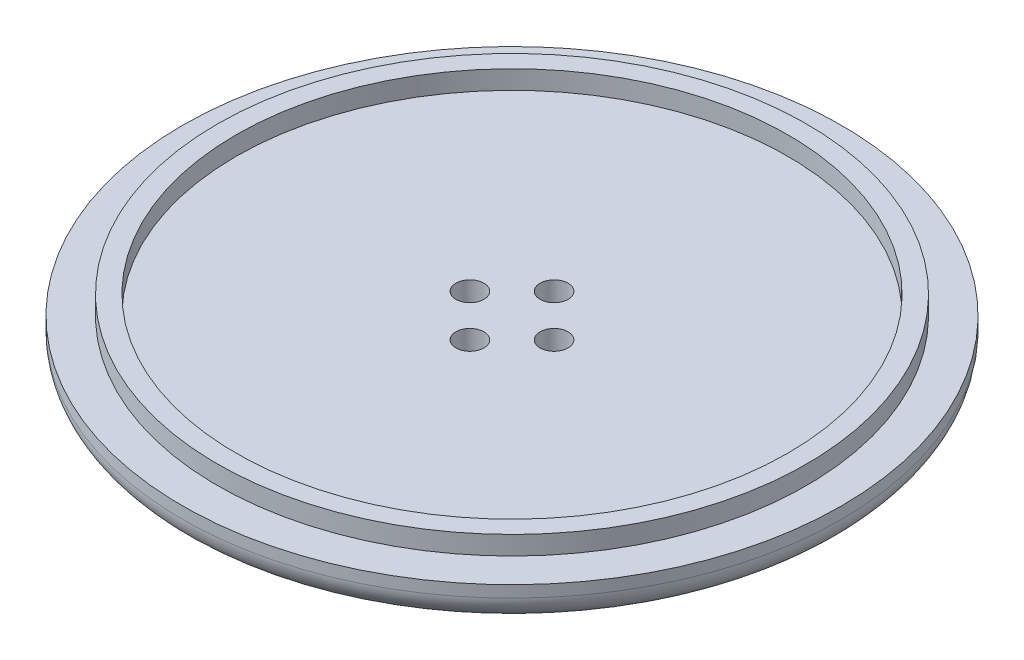
ISO-10303-21;
HEADER;
FILE_DESCRIPTION(('STEP AP214'),'2;1');
FILE_NAME('part.step','',(''),(''),'','','');
FILE_SCHEMA(('AUTOMOTIVE_DESIGN { 1 0 10303 214 1 1 1 1 }'));
ENDSEC;
DATA;
#1=APPLICATION_CONTEXT('core data for automotive mechanical design processes');
#2=APPLICATION_PROTOCOL_DEFINITION('international standard','automotive_design',2000,#1);
#3=PRODUCT_CONTEXT('',#1,'mechanical');
#4=PRODUCT('Part','Part','',(#3));
#5=PRODUCT_RELATED_PRODUCT_CATEGORY('part','',(#4));
#6=PRODUCT_DEFINITION_FORMATION('','',#4);
#7=PRODUCT_DEFINITION_CONTEXT('part definition',#1,'design');
#8=PRODUCT_DEFINITION('design','',#6,#7);
#9=PRODUCT_DEFINITION_SHAPE('','',#8);
#10=(LENGTH_UNIT() NAMED_UNIT(*) SI_UNIT(.MILLI.,.METRE.));
#11=(NAMED_UNIT(*) PLANE_ANGLE_UNIT() SI_UNIT($,.RADIAN.));
#12=(NAMED_UNIT(*) SI_UNIT($,.STERADIAN.) SOLID_ANGLE_UNIT());
#13=UNCERTAINTY_MEASURE_WITH_UNIT(LENGTH_MEASURE(1.E-05),#10,'distance_accuracy_value','');
#14=(GEOMETRIC_REPRESENTATION_CONTEXT(3) GLOBAL_UNCERTAINTY_ASSIGNED_CONTEXT((#13)) GLOBAL_UNIT_ASSIGNED_CONTEXT((#10,
#11,#12)) REPRESENTATION_CONTEXT('',''));
#15=CARTESIAN_POINT('',(0.,0.,0.));
#16=DIRECTION('',(0.,0.,1.));
#17=DIRECTION('',(1.,0.,0.));
#18=AXIS2_PLACEMENT_3D('',#15,#16,#17);
#19=CARTESIAN_POINT('',(55.5000026361085,129.291677668399,0.));
#20=DIRECTION('',(0.,-1.,0.));
#21=DIRECTION('',(-1.,0.,0.));
#22=AXIS2_PLACEMENT_3D('',#19,#20,#21);
#23=CYLINDRICAL_SURFACE('',#22,35.2437204650337);
#24=CARTESIAN_POINT('',(55.5000026361085,129.914426858839,0.));
#25=DIRECTION('',(0.,1.,0.));
#26=DIRECTION('',(1.,0.,0.));
#27=AXIS2_PLACEMENT_3D('',#24,#25,#26);
#28=CIRCLE('',#27,35.2437204650337);
#29=CARTESIAN_POINT('',(20.2562821710748,129.914426858839,0.));
#30=VERTEX_POINT('',#29);
#31=EDGE_CURVE('E97',#30,#30,#28,.T.);
#32=ORIENTED_EDGE('',*,*,#31,.F.);
#33=EDGE_LOOP('',(#32));
#34=FACE_BOUND('',#33,.T.);
#35=CARTESIAN_POINT('',(55.5000026361085,128.668928477959,0.));
#36=DIRECTION('',(0.,1.,0.));
#37=DIRECTION('',(1.,0.,0.));
#38=AXIS2_PLACEMENT_3D('',#35,#36,#37);
#39=CIRCLE('',#38,35.2437204650337);
#40=CARTESIAN_POINT('',(20.2562821710748,128.668928477959,0.));
#41=VERTEX_POINT('',#40);
#42=EDGE_CURVE('E10',#41,#41,#39,.T.);
#43=ORIENTED_EDGE('',*,*,#42,.T.);
#44=EDGE_LOOP('',(#43));
#45=FACE_BOUND('',#44,.T.);
#46=ADVANCED_FACE('F15',(#34,#45),#23,.T.);
#47=CARTESIAN_POINT('',(55.5000026361085,128.668928477959,0.));
#48=DIRECTION('',(0.,1.,0.));
#49=DIRECTION('',(0.,0.,1.));
#50=AXIS2_PLACEMENT_3D('',#47,#48,#49);
#51=TOROIDAL_SURFACE('',#50,32.4937204650337,2.75000000000005);
#52=ORIENTED_EDGE('',*,*,#42,.F.);
#53=EDGE_LOOP('',(#52));
#54=FACE_BOUND('',#53,.T.);
#55=CARTESIAN_POINT('',(55.5000026361085,125.918928477959,0.));
#56=DIRECTION('',(0.,1.,0.));
#57=DIRECTION('',(1.,0.,0.));
#58=AXIS2_PLACEMENT_3D('',#55,#56,#57);
#59=CIRCLE('',#58,32.4937204650338);
#60=CARTESIAN_POINT('',(23.0062821710748,125.918928477959,0.));
#61=VERTEX_POINT('',#60);
#62=EDGE_CURVE('E25',#61,#61,#59,.T.);
#63=ORIENTED_EDGE('',*,*,#62,.T.);
#64=EDGE_LOOP('',(#63));
#65=FACE_BOUND('',#64,.T.);
#66=ADVANCED_FACE('F171',(#54,#65),#51,.T.);
#67=CARTESIAN_POINT('',(23.0062821710748,125.918928477959,0.));
#68=DIRECTION('',(0.,-1.,0.));
#69=DIRECTION('',(0.,0.,-1.));
#70=AXIS2_PLACEMENT_3D('',#67,#68,#69);
#71=PLANE('',#70);
#72=ORIENTED_EDGE('',*,*,#62,.F.);
#73=EDGE_LOOP('',(#72));
#74=FACE_BOUND('',#73,.T.);
#75=CARTESIAN_POINT('',(55.5000026361085,125.918928477959,0.));
#76=DIRECTION('',(0.,1.,0.));
#77=DIRECTION('',(1.,0.,0.));
#78=AXIS2_PLACEMENT_3D('',#75,#76,#77);
#79=CIRCLE('',#78,19.0000020698644);
#80=CARTESIAN_POINT('',(36.5000005662441,125.918928477959,0.));
#81=VERTEX_POINT('',#80);
#82=EDGE_CURVE('E111',#81,#81,#79,.T.);
#83=ORIENTED_EDGE('',*,*,#82,.T.);
#84=EDGE_LOOP('',(#83));
#85=FACE_BOUND('',#84,.T.);
#86=ADVANCED_FACE('F177',(#74,#85),#71,.T.);
#87=CARTESIAN_POINT('',(55.5000026361085,124.418928477959,0.));
#88=DIRECTION('',(0.,1.,0.));
#89=DIRECTION('',(0.,0.,1.));
#90=AXIS2_PLACEMENT_3D('',#87,#88,#89);
#91=TOROIDAL_SURFACE('',#90,19.0000020698644,1.5);
#92=ORIENTED_EDGE('',*,*,#82,.F.);
#93=EDGE_LOOP('',(#92));
#94=FACE_BOUND('',#93,.T.);
#95=CARTESIAN_POINT('',(55.5000026361085,124.418928477959,0.));
#96=DIRECTION('',(0.,1.,0.));
#97=DIRECTION('',(1.,0.,0.));
#98=AXIS2_PLACEMENT_3D('',#95,#96,#97);
#99=CIRCLE('',#98,17.5000020698644);
#100=CARTESIAN_POINT('',(38.0000005662441,124.418928477959,0.));
#101=VERTEX_POINT('',#100);
#102=EDGE_CURVE('E19',#101,#101,#99,.T.);
#103=ORIENTED_EDGE('',*,*,#102,.T.);
#104=EDGE_LOOP('',(#103));
#105=FACE_BOUND('',#104,.T.);
#106=ADVANCED_FACE('F17',(#94,#105),#91,.F.);
#107=CARTESIAN_POINT('',(55.5000026361085,124.168928477959,0.));
#108=DIRECTION('',(0.,-1.,0.));
#109=DIRECTION('',(-1.,0.,0.));
#110=AXIS2_PLACEMENT_3D('',#107,#108,#109);
#111=CYLINDRICAL_SURFACE('',#110,17.5000020698644);
#112=ORIENTED_EDGE('',*,*,#102,.F.);
#113=EDGE_LOOP('',(#112));
#114=FACE_BOUND('',#113,.T.);
#115=CARTESIAN_POINT('',(55.5000026361085,123.918928477959,0.));
#116=DIRECTION('',(0.,1.,0.));
#117=DIRECTION('',(1.,0.,0.));
#118=AXIS2_PLACEMENT_3D('',#115,#116,#117);
#119=CIRCLE('',#118,17.5000020698644);
#120=CARTESIAN_POINT('',(38.0000005662441,123.918928477959,0.));
#121=VERTEX_POINT('',#120);
#122=EDGE_CURVE('E81',#121,#121,#119,.T.);
#123=ORIENTED_EDGE('',*,*,#122,.T.);
#124=EDGE_LOOP('',(#123));
#125=FACE_BOUND('',#124,.T.);
#126=ADVANCED_FACE('F123',(#114,#125),#111,.T.);
#127=CARTESIAN_POINT('',(55.5000026361085,123.918928477959,0.));
#128=DIRECTION('',(0.,1.,0.));
#129=DIRECTION('',(0.,0.,1.));
#130=AXIS2_PLACEMENT_3D('',#127,#128,#129);
#131=TOROIDAL_SURFACE('',#130,16.5000020698644,1.);
#132=ORIENTED_EDGE('',*,*,#122,.F.);
#133=EDGE_LOOP('',(#132));
#134=FACE_BOUND('',#133,.T.);
#135=CARTESIAN_POINT('',(55.5000026361085,122.918928477959,0.));
#136=DIRECTION('',(0.,1.,0.));
#137=DIRECTION('',(1.,0.,0.));
#138=AXIS2_PLACEMENT_3D('',#135,#136,#137);
#139=CIRCLE('',#138,16.5000020698644);
#140=CARTESIAN_POINT('',(39.0000005662441,122.918928477959,0.));
#141=VERTEX_POINT('',#140);
#142=EDGE_CURVE('E93',#141,#141,#139,.T.);
#143=ORIENTED_EDGE('',*,*,#142,.T.);
#144=EDGE_LOOP('',(#143));
#145=FACE_BOUND('',#144,.T.);
#146=ADVANCED_FACE('F126',(#134,#145),#131,.T.);
#147=CARTESIAN_POINT('',(55.5000026361085,129.918928477959,0.));
#148=DIRECTION('',(0.,1.,0.));
#149=DIRECTION('',(0.,0.,1.));
#150=AXIS2_PLACEMENT_3D('',#147,#148,#149);
#151=PLANE('',#150);
#152=CARTESIAN_POINT('',(55.5000026361085,129.918928477959,0.));
#153=DIRECTION('',(0.,1.,0.));
#154=DIRECTION('',(1.,0.,0.));
#155=AXIS2_PLACEMENT_3D('',#152,#153,#154);
#156=CIRCLE('',#155,29.5000022486783);
#157=CARTESIAN_POINT('',(26.0000003874302,129.918928477959,0.));
#158=VERTEX_POINT('',#157);
#159=EDGE_CURVE('E79',#158,#158,#156,.T.);
#160=ORIENTED_EDGE('',*,*,#159,.T.);
#161=EDGE_LOOP('',(#160));
#162=FACE_BOUND('',#161,.T.);
#163=CARTESIAN_POINT('',(55.5000026361085,129.918928477959,4.50000187614932));
#164=DIRECTION('',(0.,-1.,0.));
#165=DIRECTION('',(-1.,0.,0.));
#166=AXIS2_PLACEMENT_3D('',#163,#164,#165);
#167=CIRCLE('',#166,1.5);
#168=CARTESIAN_POINT('',(57.0000026361085,129.918928477959,4.50000187614932));
#169=VERTEX_POINT('',#168);
#170=EDGE_CURVE('E98',#169,#169,#167,.T.);
#171=ORIENTED_EDGE('',*,*,#170,.T.);
#172=EDGE_LOOP('',(#171));
#173=FACE_BOUND('',#172,.T.);
#174=CARTESIAN_POINT('',(51.0000007599592,129.918928477959,0.));
#175=DIRECTION('',(0.,-1.,0.));
#176=DIRECTION('',(-1.,0.,0.));
#177=AXIS2_PLACEMENT_3D('',#174,#175,#176);
#178=CIRCLE('',#177,1.5);
#179=CARTESIAN_POINT('',(52.5000007599592,129.918928477959,0.));
#180=VERTEX_POINT('',#179);
#181=EDGE_CURVE('E108',#180,#180,#178,.T.);
#182=ORIENTED_EDGE('',*,*,#181,.T.);
#183=EDGE_LOOP('',(#182));
#184=FACE_BOUND('',#183,.T.);
#185=CARTESIAN_POINT('',(60.0000045122579,129.918928477959,0.));
#186=DIRECTION('',(0.,-1.,0.));
#187=DIRECTION('',(-1.,0.,0.));
#188=AXIS2_PLACEMENT_3D('',#185,#186,#187);
#189=CIRCLE('',#188,1.5);
#190=CARTESIAN_POINT('',(61.5000045122579,129.918928477959,0.));
#191=VERTEX_POINT('',#190);
#192=EDGE_CURVE('E107',#191,#191,#189,.T.);
#193=ORIENTED_EDGE('',*,*,#192,.T.);
#194=EDGE_LOOP('',(#193));
#195=FACE_BOUND('',#194,.T.);
#196=CARTESIAN_POINT('',(55.5000026361085,129.918928477959,-4.50000187614932));
#197=DIRECTION('',(0.,-1.,0.));
#198=DIRECTION('',(-1.,0.,0.));
#199=AXIS2_PLACEMENT_3D('',#196,#197,#198);
#200=CIRCLE('',#199,1.5);
#201=CARTESIAN_POINT('',(57.0000026361085,129.918928477959,-4.50000187614932));
#202=VERTEX_POINT('',#201);
#203=EDGE_CURVE('E103',#202,#202,#200,.T.);
#204=ORIENTED_EDGE('',*,*,#203,.T.);
#205=EDGE_LOOP('',(#204));
#206=FACE_BOUND('',#205,.T.);
#207=ADVANCED_FACE('F132',(#162,#173,#184,#195,#206),#151,.T.);
#208=CARTESIAN_POINT('',(55.5000026361085,130.918928477959,0.));
#209=DIRECTION('',(0.,-1.,0.));
#210=DIRECTION('',(-1.,0.,0.));
#211=AXIS2_PLACEMENT_3D('',#208,#209,#210);
#212=CYLINDRICAL_SURFACE('',#211,29.5000022486783);
#213=ORIENTED_EDGE('',*,*,#159,.F.);
#214=EDGE_LOOP('',(#213));
#215=FACE_BOUND('',#214,.T.);
#216=CARTESIAN_POINT('',(55.5000026361085,131.918928477959,0.));
#217=DIRECTION('',(0.,1.,0.));
#218=DIRECTION('',(1.,0.,0.));
#219=AXIS2_PLACEMENT_3D('',#216,#217,#218);
#220=CIRCLE('',#219,29.5000022486783);
#221=CARTESIAN_POINT('',(26.0000003874302,131.918928477959,0.));
#222=VERTEX_POINT('',#221);
#223=EDGE_CURVE('E76',#222,#222,#220,.T.);
#224=ORIENTED_EDGE('',*,*,#223,.T.);
#225=EDGE_LOOP('',(#224));
#226=FACE_BOUND('',#225,.T.);
#227=ADVANCED_FACE('F77',(#215,#226),#212,.F.);
#228=CARTESIAN_POINT('',(26.0000003874302,131.918928477959,0.));
#229=DIRECTION('',(0.,1.,0.));
#230=DIRECTION('',(0.,0.,1.));
#231=AXIS2_PLACEMENT_3D('',#228,#229,#230);
#232=PLANE('',#231);
#233=ORIENTED_EDGE('',*,*,#223,.F.);
#234=EDGE_LOOP('',(#233));
#235=FACE_BOUND('',#234,.T.);
#236=CARTESIAN_POINT('',(55.5000026361085,131.918928477959,0.));
#237=DIRECTION('',(0.,1.,0.));
#238=DIRECTION('',(1.,0.,0.));
#239=AXIS2_PLACEMENT_3D('',#236,#237,#238);
#240=CIRCLE('',#239,31.5000022784807);
#241=CARTESIAN_POINT('',(24.0000003576279,131.918928477959,0.));
#242=VERTEX_POINT('',#241);
#243=EDGE_CURVE('E72',#242,#242,#240,.T.);
#244=ORIENTED_EDGE('',*,*,#243,.T.);
#245=EDGE_LOOP('',(#244));
#246=FACE_BOUND('',#245,.T.);
#247=ADVANCED_FACE('F216',(#235,#246),#232,.T.);
#248=CARTESIAN_POINT('',(55.5000026361085,130.918928477959,0.));
#249=DIRECTION('',(0.,-1.,0.));
#250=DIRECTION('',(-1.,0.,0.));
#251=AXIS2_PLACEMENT_3D('',#248,#249,#250);
#252=CYLINDRICAL_SURFACE('',#251,31.5000022784807);
#253=ORIENTED_EDGE('',*,*,#243,.F.);
#254=EDGE_LOOP('',(#253));
#255=FACE_BOUND('',#254,.T.);
#256=CARTESIAN_POINT('',(55.5000026361085,129.918928477959,0.));
#257=DIRECTION('',(0.,1.,0.));
#258=DIRECTION('',(1.,0.,0.));
#259=AXIS2_PLACEMENT_3D('',#256,#257,#258);
#260=CIRCLE('',#259,31.5000022784807);
#261=CARTESIAN_POINT('',(24.0000003576279,129.918928477959,0.));
#262=VERTEX_POINT('',#261);
#263=EDGE_CURVE('E83',#262,#262,#260,.T.);
#264=ORIENTED_EDGE('',*,*,#263,.T.);
#265=EDGE_LOOP('',(#264));
#266=FACE_BOUND('',#265,.T.);
#267=ADVANCED_FACE('F189',(#255,#266),#252,.T.);
#268=CARTESIAN_POINT('',(55.5000026361085,129.916677668399,0.));
#269=DIRECTION('',(0.,-1.,0.));
#270=DIRECTION('',(-1.,0.,0.));
#271=AXIS2_PLACEMENT_3D('',#268,#269,#270);
#272=CONICAL_SURFACE('',#271,33.3718613717572,1.56959388133132);
#273=ORIENTED_EDGE('',*,*,#263,.F.);
#274=EDGE_LOOP('',(#273));
#275=FACE_BOUND('',#274,.T.);
#276=ORIENTED_EDGE('',*,*,#31,.T.);
#277=EDGE_LOOP('',(#276));
#278=FACE_BOUND('',#277,.T.);
#279=ADVANCED_FACE('F186',(#275,#278),#272,.T.);
#280=CARTESIAN_POINT('',(55.5000026361085,160.418928626971,4.50000187614932));
#281=DIRECTION('',(0.,1.,0.));
#282=DIRECTION('',(-1.,0.,0.));
#283=AXIS2_PLACEMENT_3D('',#280,#281,#282);
#284=CYLINDRICAL_SURFACE('',#283,1.5);
#285=ORIENTED_EDGE('',*,*,#170,.F.);
#286=EDGE_LOOP('',(#285));
#287=FACE_BOUND('',#286,.T.);
#288=CARTESIAN_POINT('',(55.5000026361085,121.918928477959,4.50000187614932));
#289=DIRECTION('',(0.,1.,0.));
#290=DIRECTION('',(-1.,0.,0.));
#291=AXIS2_PLACEMENT_3D('',#288,#289,#290);
#292=CIRCLE('',#291,1.5);
#293=CARTESIAN_POINT('',(57.0000026361085,121.918928477959,4.50000187614932));
#294=VERTEX_POINT('',#293);
#295=EDGE_CURVE('E100',#294,#294,#292,.T.);
#296=ORIENTED_EDGE('',*,*,#295,.F.);
#297=EDGE_LOOP('',(#296));
#298=FACE_BOUND('',#297,.T.);
#299=ADVANCED_FACE('F184',(#287,#298),#284,.F.);
#300=CARTESIAN_POINT('',(51.0000007599592,160.418928626971,0.));
#301=DIRECTION('',(0.,1.,0.));
#302=DIRECTION('',(-1.,0.,0.));
#303=AXIS2_PLACEMENT_3D('',#300,#301,#302);
#304=CYLINDRICAL_SURFACE('',#303,1.5);
#305=ORIENTED_EDGE('',*,*,#181,.F.);
#306=EDGE_LOOP('',(#305));
#307=FACE_BOUND('',#306,.T.);
#308=CARTESIAN_POINT('',(51.0000007599592,121.918928477959,0.));
#309=DIRECTION('',(0.,1.,0.));
#310=DIRECTION('',(-1.,0.,0.));
#311=AXIS2_PLACEMENT_3D('',#308,#309,#310);
#312=CIRCLE('',#311,1.5);
#313=CARTESIAN_POINT('',(52.5000007599592,121.918928477959,0.));
#314=VERTEX_POINT('',#313);
#315=EDGE_CURVE('E104',#314,#314,#312,.T.);
#316=ORIENTED_EDGE('',*,*,#315,.F.);
#317=EDGE_LOOP('',(#316));
#318=FACE_BOUND('',#317,.T.);
#319=ADVANCED_FACE('F165',(#307,#318),#304,.F.);
#320=CARTESIAN_POINT('',(60.0000045122579,160.418928626971,0.));
#321=DIRECTION('',(0.,1.,0.));
#322=DIRECTION('',(-1.,0.,0.));
#323=AXIS2_PLACEMENT_3D('',#320,#321,#322);
#324=CYLINDRICAL_SURFACE('',#323,1.5);
#325=ORIENTED_EDGE('',*,*,#192,.F.);
#326=EDGE_LOOP('',(#325));
#327=FACE_BOUND('',#326,.T.);
#328=CARTESIAN_POINT('',(60.0000045122579,121.918928477959,0.));
#329=DIRECTION('',(0.,1.,0.));
#330=DIRECTION('',(-1.,0.,0.));
#331=AXIS2_PLACEMENT_3D('',#328,#329,#330);
#332=CIRCLE('',#331,1.5);
#333=CARTESIAN_POINT('',(61.5000045122579,121.918928477959,0.));
#334=VERTEX_POINT('',#333);
#335=EDGE_CURVE('E92',#334,#334,#332,.T.);
#336=ORIENTED_EDGE('',*,*,#335,.F.);
#337=EDGE_LOOP('',(#336));
#338=FACE_BOUND('',#337,.T.);
#339=ADVANCED_FACE('F158',(#327,#338),#324,.F.);
#340=CARTESIAN_POINT('',(55.5000026361085,160.418928626971,-4.50000187614932));
#341=DIRECTION('',(0.,1.,0.));
#342=DIRECTION('',(-1.,0.,0.));
#343=AXIS2_PLACEMENT_3D('',#340,#341,#342);
#344=CYLINDRICAL_SURFACE('',#343,1.5);
#345=ORIENTED_EDGE('',*,*,#203,.F.);
#346=EDGE_LOOP('',(#345));
#347=FACE_BOUND('',#346,.T.);
#348=CARTESIAN_POINT('',(55.5000026361085,121.918928477959,-4.50000187614932));
#349=DIRECTION('',(0.,1.,0.));
#350=DIRECTION('',(-1.,0.,0.));
#351=AXIS2_PLACEMENT_3D('',#348,#349,#350);
#352=CIRCLE('',#351,1.5);
#353=CARTESIAN_POINT('',(57.0000026361085,121.918928477959,-4.50000187614932));
#354=VERTEX_POINT('',#353);
#355=EDGE_CURVE('E89',#354,#354,#352,.T.);
#356=ORIENTED_EDGE('',*,*,#355,.F.);
#357=EDGE_LOOP('',(#356));
#358=FACE_BOUND('',#357,.T.);
#359=ADVANCED_FACE('F146',(#347,#358),#344,.F.);
#360=CARTESIAN_POINT('',(39.0000005662441,121.918928477959,0.));
#361=DIRECTION('',(0.,-1.,0.));
#362=DIRECTION('',(0.,0.,-1.));
#363=AXIS2_PLACEMENT_3D('',#360,#361,#362);
#364=PLANE('',#363);
#365=CARTESIAN_POINT('',(55.5000026361085,121.918928477959,0.));
#366=DIRECTION('',(0.,-1.,0.));
#367=DIRECTION('',(1.,0.,0.));
#368=AXIS2_PLACEMENT_3D('',#365,#366,#367);
#369=CIRCLE('',#368,16.5000020698644);
#370=CARTESIAN_POINT('',(39.0000005662441,121.918928477959,0.));
#371=VERTEX_POINT('',#370);
#372=EDGE_CURVE('E87',#371,#371,#369,.T.);
#373=ORIENTED_EDGE('',*,*,#372,.T.);
#374=EDGE_LOOP('',(#373));
#375=FACE_BOUND('',#374,.T.);
#376=ORIENTED_EDGE('',*,*,#295,.T.);
#377=EDGE_LOOP('',(#376));
#378=FACE_BOUND('',#377,.T.);
#379=ORIENTED_EDGE('',*,*,#315,.T.);
#380=EDGE_LOOP('',(#379));
#381=FACE_BOUND('',#380,.T.);
#382=ORIENTED_EDGE('',*,*,#335,.T.);
#383=EDGE_LOOP('',(#382));
#384=FACE_BOUND('',#383,.T.);
#385=ORIENTED_EDGE('',*,*,#355,.T.);
#386=EDGE_LOOP('',(#385));
#387=FACE_BOUND('',#386,.T.);
#388=ADVANCED_FACE('F140',(#375,#378,#381,#384,#387),#364,.T.);
#389=CARTESIAN_POINT('',(55.5000026361085,122.918928477959,0.));
#390=DIRECTION('',(0.,1.,0.));
#391=DIRECTION('',(1.,0.,0.));
#392=AXIS2_PLACEMENT_3D('',#389,#390,#391);
#393=CYLINDRICAL_SURFACE('',#392,16.5000020698644);
#394=ORIENTED_EDGE('',*,*,#142,.F.);
#395=EDGE_LOOP('',(#394));
#396=FACE_BOUND('',#395,.T.);
#397=ORIENTED_EDGE('',*,*,#372,.F.);
#398=EDGE_LOOP('',(#397));
#399=FACE_BOUND('',#398,.T.);
#400=ADVANCED_FACE('F137',(#396,#399),#393,.T.);
#401=CLOSED_SHELL('',(#46,#66,#86,#106,#126,#146,#207,#227,#247,#267,#279,#299,#319,#339,#359,
#388,#400));
#402=MANIFOLD_SOLID_BREP('B1',#401);
#403=ADVANCED_BREP_SHAPE_REPRESENTATION('',(#18,#402),#14);
#404=SHAPE_DEFINITION_REPRESENTATION(#9,#403);
ENDSEC;
END-ISO-10303-21;
